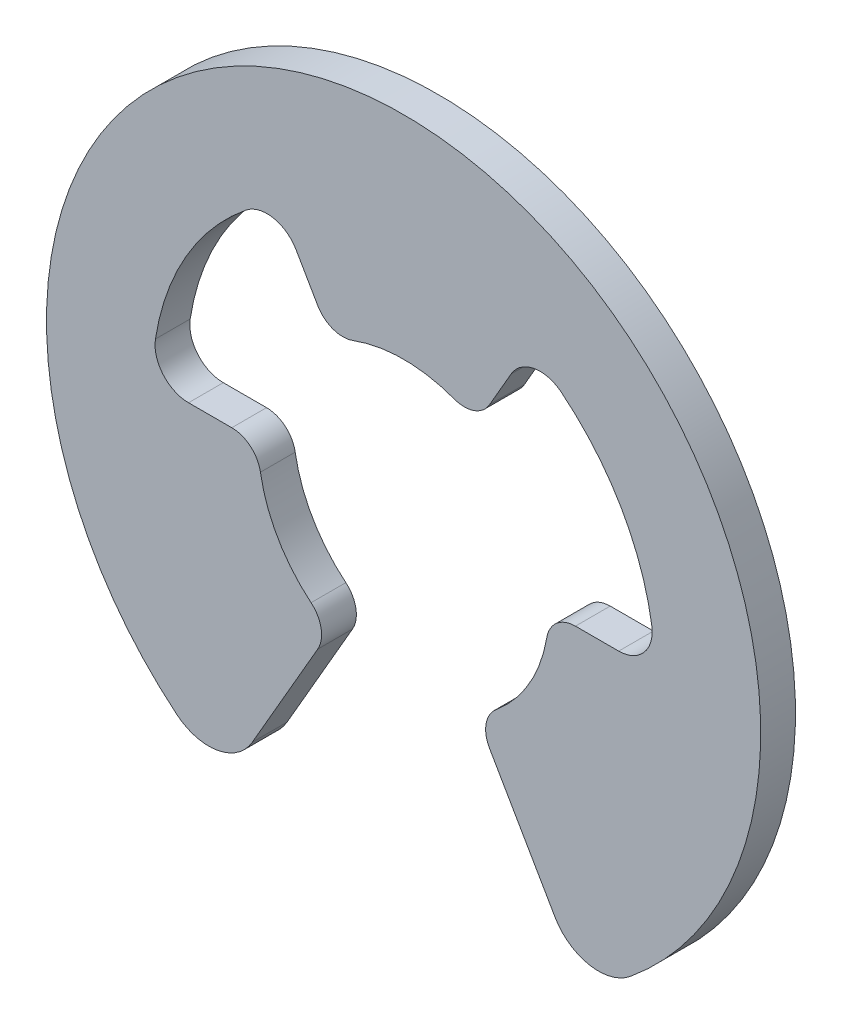
ISO-10303-21;
HEADER;
FILE_DESCRIPTION(('STEP AP214'),'2;1');
FILE_NAME('part.step','',(''),(''),'','','');
FILE_SCHEMA(('AUTOMOTIVE_DESIGN { 1 0 10303 214 1 1 1 1 }'));
ENDSEC;
DATA;
#1=APPLICATION_CONTEXT('core data for automotive mechanical design processes');
#2=APPLICATION_PROTOCOL_DEFINITION('international standard','automotive_design',2000,#1);
#3=PRODUCT_CONTEXT('',#1,'mechanical');
#4=PRODUCT('Part','Part','',(#3));
#5=PRODUCT_RELATED_PRODUCT_CATEGORY('part','',(#4));
#6=PRODUCT_DEFINITION_FORMATION('','',#4);
#7=PRODUCT_DEFINITION_CONTEXT('part definition',#1,'design');
#8=PRODUCT_DEFINITION('design','',#6,#7);
#9=PRODUCT_DEFINITION_SHAPE('','',#8);
#10=(LENGTH_UNIT() NAMED_UNIT(*) SI_UNIT(.MILLI.,.METRE.));
#11=(NAMED_UNIT(*) PLANE_ANGLE_UNIT() SI_UNIT($,.RADIAN.));
#12=(NAMED_UNIT(*) SI_UNIT($,.STERADIAN.) SOLID_ANGLE_UNIT());
#13=UNCERTAINTY_MEASURE_WITH_UNIT(LENGTH_MEASURE(1.E-05),#10,'distance_accuracy_value','');
#14=(GEOMETRIC_REPRESENTATION_CONTEXT(3) GLOBAL_UNCERTAINTY_ASSIGNED_CONTEXT((#13)) GLOBAL_UNIT_ASSIGNED_CONTEXT((#10,
#11,#12)) REPRESENTATION_CONTEXT('',''));
#15=CARTESIAN_POINT('',(0.,0.,0.));
#16=DIRECTION('',(0.,0.,1.));
#17=DIRECTION('',(1.,0.,0.));
#18=AXIS2_PLACEMENT_3D('',#15,#16,#17);
#19=CARTESIAN_POINT('',(2.2915935039836,-3.9691563791944,0.46355));
#20=DIRECTION('',(0.866025403784439,0.499999999999999,0.));
#21=DIRECTION('',(-0.499999999999999,0.866025403784439,0.));
#22=AXIS2_PLACEMENT_3D('',#19,#20,#21);
#23=PLANE('',#22);
#24=DIRECTION('',(0.499999999999998,-0.86602540378444,0.));
#25=VECTOR('',#24,1.);
#26=CARTESIAN_POINT('',(2.2915935039836,-3.9691563791944,-0.46355));
#27=LINE('',#26,#25);
#28=CARTESIAN_POINT('',(2.2915935039836,-3.9691563791944,-0.46355));
#29=VERTEX_POINT('',#28);
#30=CARTESIAN_POINT('',(4.037371747189,-6.99293299517449,-0.46355));
#31=VERTEX_POINT('',#30);
#32=EDGE_CURVE('E11',#29,#31,#27,.T.);
#33=ORIENTED_EDGE('',*,*,#32,.T.);
#34=DIRECTION('',(0.,0.,-1.));
#35=VECTOR('',#34,1.);
#36=CARTESIAN_POINT('',(4.037371747189,-6.99293299517449,0.46355));
#37=LINE('',#36,#35);
#38=CARTESIAN_POINT('',(4.037371747189,-6.99293299517449,0.46355));
#39=VERTEX_POINT('',#38);
#40=EDGE_CURVE('E25',#39,#31,#37,.T.);
#41=ORIENTED_EDGE('',*,*,#40,.F.);
#42=DIRECTION('',(0.499999999999998,-0.86602540378444,0.));
#43=VECTOR('',#42,1.);
#44=CARTESIAN_POINT('',(2.2915935039836,-3.9691563791944,0.46355));
#45=LINE('',#44,#43);
#46=CARTESIAN_POINT('',(2.2915935039836,-3.9691563791944,0.46355));
#47=VERTEX_POINT('',#46);
#48=EDGE_CURVE('E352',#47,#39,#45,.T.);
#49=ORIENTED_EDGE('',*,*,#48,.F.);
#50=DIRECTION('',(0.,0.,-1.));
#51=VECTOR('',#50,1.);
#52=CARTESIAN_POINT('',(2.2915935039836,-3.9691563791944,0.46355));
#53=LINE('',#52,#51);
#54=EDGE_CURVE('E348',#47,#29,#53,.T.);
#55=ORIENTED_EDGE('',*,*,#54,.T.);
#56=EDGE_LOOP('',(#33,#41,#49,#55));
#57=FACE_BOUND('',#56,.T.);
#58=ADVANCED_FACE('F17',(#57),#23,.F.);
#59=CARTESIAN_POINT('',(2.9625033842955,-3.58180637919445,0.46355));
#60=DIRECTION('',(0.,0.,1.));
#61=DIRECTION('',(0.984186439950093,-0.177135686461996,0.));
#62=AXIS2_PLACEMENT_3D('',#59,#60,#61);
#63=CYLINDRICAL_SURFACE('',#62,0.7747);
#64=CARTESIAN_POINT('',(2.9625033842955,-3.58180637919445,-0.46355));
#65=DIRECTION('',(0.,0.,1.));
#66=DIRECTION('',(1.,0.,0.));
#67=AXIS2_PLACEMENT_3D('',#64,#65,#66);
#68=CIRCLE('',#67,0.7747);
#69=CARTESIAN_POINT('',(2.4687528202462,-2.98483864932869,-0.46355));
#70=VERTEX_POINT('',#69);
#71=EDGE_CURVE('E343',#70,#29,#68,.T.);
#72=ORIENTED_EDGE('',*,*,#71,.T.);
#73=ORIENTED_EDGE('',*,*,#54,.F.);
#74=CARTESIAN_POINT('',(2.9625033842955,-3.58180637919445,0.46355));
#75=DIRECTION('',(0.,0.,1.));
#76=DIRECTION('',(1.,0.,0.));
#77=AXIS2_PLACEMENT_3D('',#74,#75,#76);
#78=CIRCLE('',#77,0.7747);
#79=CARTESIAN_POINT('',(2.4687528202462,-2.98483864932869,0.46355));
#80=VERTEX_POINT('',#79);
#81=EDGE_CURVE('E338',#80,#47,#78,.T.);
#82=ORIENTED_EDGE('',*,*,#81,.F.);
#83=DIRECTION('',(0.,0.,-1.));
#84=VECTOR('',#83,1.);
#85=CARTESIAN_POINT('',(2.4687528202462,-2.98483864932869,0.46355));
#86=LINE('',#85,#84);
#87=EDGE_CURVE('E334',#80,#70,#86,.T.);
#88=ORIENTED_EDGE('',*,*,#87,.T.);
#89=EDGE_LOOP('',(#72,#73,#82,#88));
#90=FACE_BOUND('',#89,.T.);
#91=ADVANCED_FACE('F365',(#90),#63,.T.);
#92=CARTESIAN_POINT('',(-2.51101223147643E-13,1.63714528045311E-13,0.46355));
#93=DIRECTION('',(0.,0.,1.));
#94=DIRECTION('',(-0.866025402257679,0.500000002644425,0.));
#95=AXIS2_PLACEMENT_3D('',#92,#93,#94);
#96=CYLINDRICAL_SURFACE('',#95,3.8735);
#97=DIRECTION('',(0.,0.,-1.));
#98=VECTOR('',#97,1.);
#99=CARTESIAN_POINT('',(3.81932250269679,-0.64558335665806,0.46355));
#100=LINE('',#99,#98);
#101=CARTESIAN_POINT('',(3.81932250269679,-0.64558335665806,0.46355));
#102=VERTEX_POINT('',#101);
#103=CARTESIAN_POINT('',(3.81932250269679,-0.64558335665806,-0.46355));
#104=VERTEX_POINT('',#103);
#105=EDGE_CURVE('E330',#102,#104,#100,.T.);
#106=ORIENTED_EDGE('',*,*,#105,.T.);
#107=CARTESIAN_POINT('',(-2.51101223147643E-13,1.63714528045311E-13,-0.46355));
#108=DIRECTION('',(0.,0.,1.));
#109=DIRECTION('',(1.,0.,0.));
#110=AXIS2_PLACEMENT_3D('',#107,#108,#109);
#111=CIRCLE('',#110,3.8735);
#112=EDGE_CURVE('E325',#70,#104,#111,.T.);
#113=ORIENTED_EDGE('',*,*,#112,.F.);
#114=ORIENTED_EDGE('',*,*,#87,.F.);
#115=CARTESIAN_POINT('',(-2.51101223147643E-13,1.63714528045311E-13,0.46355));
#116=DIRECTION('',(0.,0.,1.));
#117=DIRECTION('',(1.,0.,0.));
#118=AXIS2_PLACEMENT_3D('',#115,#116,#117);
#119=CIRCLE('',#118,3.8735);
#120=EDGE_CURVE('E321',#80,#102,#119,.T.);
#121=ORIENTED_EDGE('',*,*,#120,.T.);
#122=EDGE_LOOP('',(#106,#113,#114,#121));
#123=FACE_BOUND('',#122,.T.);
#124=ADVANCED_FACE('F372',(#123),#96,.F.);
#125=CARTESIAN_POINT('',(5.19771588444955,-6.32300799517454,0.46355));
#126=DIRECTION('',(0.,0.,1.));
#127=DIRECTION('',(1.,0.,0.));
#128=AXIS2_PLACEMENT_3D('',#125,#126,#127);
#129=PLANE('',#128);
#130=CARTESIAN_POINT('',(5.19771588444955,-6.32300799517454,0.46355));
#131=DIRECTION('',(0.,0.,1.));
#132=DIRECTION('',(1.,0.,0.));
#133=AXIS2_PLACEMENT_3D('',#130,#131,#132);
#134=CIRCLE('',#133,1.33985);
#135=CARTESIAN_POINT('',(6.04854438804611,-7.35803885460221,0.46355));
#136=VERTEX_POINT('',#135);
#137=EDGE_CURVE('E317',#39,#136,#134,.T.);
#138=ORIENTED_EDGE('',*,*,#137,.T.);
#139=CARTESIAN_POINT('',(0.,0.,0.46355));
#140=DIRECTION('',(0.,0.,1.));
#141=DIRECTION('',(1.,0.,0.));
#142=AXIS2_PLACEMENT_3D('',#139,#140,#141);
#143=CIRCLE('',#142,9.525);
#144=CARTESIAN_POINT('',(-6.04854447375821,-7.3580387841441,0.46355));
#145=VERTEX_POINT('',#144);
#146=EDGE_CURVE('E189',#136,#145,#143,.T.);
#147=ORIENTED_EDGE('',*,*,#146,.T.);
#148=CARTESIAN_POINT('',(-5.19771588444955,-6.32300799517454,0.46355));
#149=DIRECTION('',(0.,0.,1.));
#150=DIRECTION('',(1.,0.,0.));
#151=AXIS2_PLACEMENT_3D('',#148,#149,#150);
#152=CIRCLE('',#151,1.33985);
#153=CARTESIAN_POINT('',(-4.037371747189,-6.99293299517449,0.46355));
#154=VERTEX_POINT('',#153);
#155=EDGE_CURVE('E310',#145,#154,#152,.T.);
#156=ORIENTED_EDGE('',*,*,#155,.T.);
#157=DIRECTION('',(0.499999999999998,0.86602540378444,0.));
#158=VECTOR('',#157,1.);
#159=CARTESIAN_POINT('',(-4.037371747189,-6.99293299517449,0.46355));
#160=LINE('',#159,#158);
#161=CARTESIAN_POINT('',(-2.2915935039836,-3.9691563791944,0.46355));
#162=VERTEX_POINT('',#161);
#163=EDGE_CURVE('E306',#154,#162,#160,.T.);
#164=ORIENTED_EDGE('',*,*,#163,.T.);
#165=CARTESIAN_POINT('',(-2.9625033842955,-3.58180637919445,0.46355));
#166=DIRECTION('',(0.,0.,1.));
#167=DIRECTION('',(1.,0.,0.));
#168=AXIS2_PLACEMENT_3D('',#165,#166,#167);
#169=CIRCLE('',#168,0.7747);
#170=CARTESIAN_POINT('',(-2.4687528202462,-2.98483864932869,0.46355));
#171=VERTEX_POINT('',#170);
#172=EDGE_CURVE('E302',#162,#171,#169,.T.);
#173=ORIENTED_EDGE('',*,*,#172,.T.);
#174=CARTESIAN_POINT('',(2.57606436182556E-13,1.69135538907739E-13,0.46355));
#175=DIRECTION('',(0.,0.,1.));
#176=DIRECTION('',(1.,0.,0.));
#177=AXIS2_PLACEMENT_3D('',#174,#175,#176);
#178=CIRCLE('',#177,3.8735);
#179=CARTESIAN_POINT('',(-3.8193225066394,-0.645583333333329,0.46355));
#180=VERTEX_POINT('',#179);
#181=EDGE_CURVE('E297',#180,#171,#178,.T.);
#182=ORIENTED_EDGE('',*,*,#181,.F.);
#183=CARTESIAN_POINT('',(-4.58318700796734,-0.774700000000079,0.46355));
#184=DIRECTION('',(0.,0.,1.));
#185=DIRECTION('',(1.,0.,0.));
#186=AXIS2_PLACEMENT_3D('',#183,#184,#185);
#187=CIRCLE('',#186,0.7747);
#188=CARTESIAN_POINT('',(-4.58318700796729,0.,0.46355));
#189=VERTEX_POINT('',#188);
#190=EDGE_CURVE('E293',#180,#189,#187,.T.);
#191=ORIENTED_EDGE('',*,*,#190,.T.);
#192=DIRECTION('',(-1.,0.,0.));
#193=VECTOR('',#192,1.);
#194=CARTESIAN_POINT('',(-4.58318700796729,0.,0.46355));
#195=LINE('',#194,#193);
#196=CARTESIAN_POINT('',(-5.73689495684149,0.,0.46355));
#197=VERTEX_POINT('',#196);
#198=EDGE_CURVE('E289',#189,#197,#195,.T.);
#199=ORIENTED_EDGE('',*,*,#198,.T.);
#200=CARTESIAN_POINT('',(-5.73689495684144,0.893233333333415,0.46355));
#201=DIRECTION('',(0.,0.,1.));
#202=DIRECTION('',(1.,0.,0.));
#203=AXIS2_PLACEMENT_3D('',#200,#201,#202);
#204=CIRCLE('',#203,0.89323333418);
#205=CARTESIAN_POINT('',(-6.61949418097101,1.0306538461538,0.46355));
#206=VERTEX_POINT('',#205);
#207=EDGE_CURVE('E284',#206,#197,#204,.T.);
#208=ORIENTED_EDGE('',*,*,#207,.F.);
#209=CARTESIAN_POINT('',(1.12757025938493E-13,-1.59594559789866E-13,0.46355));
#210=DIRECTION('',(0.,0.,1.));
#211=DIRECTION('',(1.,0.,0.));
#212=AXIS2_PLACEMENT_3D('',#209,#210,#211);
#213=CIRCLE('',#212,6.69925);
#214=CARTESIAN_POINT('',(-4.2023195037628,5.21732319784721,0.46355));
#215=VERTEX_POINT('',#214);
#216=EDGE_CURVE('E279',#215,#206,#213,.T.);
#217=ORIENTED_EDGE('',*,*,#216,.F.);
#218=CARTESIAN_POINT('',(-3.64201023659442,4.52168010480082,0.46355));
#219=DIRECTION('',(0.,0.,1.));
#220=DIRECTION('',(1.,0.,0.));
#221=AXIS2_PLACEMENT_3D('',#218,#219,#220);
#222=CIRCLE('',#221,0.89323333418);
#223=CARTESIAN_POINT('',(-2.8684474784207,4.96829677146761,0.46355));
#224=VERTEX_POINT('',#223);
#225=EDGE_CURVE('E274',#224,#215,#222,.T.);
#226=ORIENTED_EDGE('',*,*,#225,.F.);
#227=DIRECTION('',(0.499999999999961,-0.866025403784461,0.));
#228=VECTOR('',#227,1.);
#229=CARTESIAN_POINT('',(-2.8684474784207,4.96829677146761,0.46355));
#230=LINE('',#229,#228);
#231=CARTESIAN_POINT('',(-2.2915935039836,3.9691563791944,0.46355));
#232=VERTEX_POINT('',#231);
#233=EDGE_CURVE('E270',#224,#232,#230,.T.);
#234=ORIENTED_EDGE('',*,*,#233,.T.);
#235=CARTESIAN_POINT('',(-1.62068362367182,4.35650637919443,0.46355));
#236=DIRECTION('',(0.,0.,1.));
#237=DIRECTION('',(1.,0.,0.));
#238=AXIS2_PLACEMENT_3D('',#235,#236,#237);
#239=CIRCLE('',#238,0.7747);
#240=CARTESIAN_POINT('',(-1.3505696449148,3.63042199809261,0.46355));
#241=VERTEX_POINT('',#240);
#242=EDGE_CURVE('E266',#232,#241,#239,.T.);
#243=ORIENTED_EDGE('',*,*,#242,.T.);
#244=CARTESIAN_POINT('',(0.,3.45643652588379E-13,0.46355));
#245=DIRECTION('',(0.,0.,1.));
#246=DIRECTION('',(1.,0.,0.));
#247=AXIS2_PLACEMENT_3D('',#244,#245,#246);
#248=CIRCLE('',#247,3.8735);
#249=CARTESIAN_POINT('',(1.3505696863932,3.63042198266201,0.46355));
#250=VERTEX_POINT('',#249);
#251=EDGE_CURVE('E261',#250,#241,#248,.T.);
#252=ORIENTED_EDGE('',*,*,#251,.F.);
#253=CARTESIAN_POINT('',(1.62068362367178,4.35650637919448,0.46355));
#254=DIRECTION('',(0.,0.,1.));
#255=DIRECTION('',(1.,0.,0.));
#256=AXIS2_PLACEMENT_3D('',#253,#254,#255);
#257=CIRCLE('',#256,0.7747);
#258=CARTESIAN_POINT('',(2.2915935039836,3.9691563791944,0.46355));
#259=VERTEX_POINT('',#258);
#260=EDGE_CURVE('E257',#250,#259,#257,.T.);
#261=ORIENTED_EDGE('',*,*,#260,.T.);
#262=DIRECTION('',(0.499999999999961,0.866025403784461,0.));
#263=VECTOR('',#262,1.);
#264=CARTESIAN_POINT('',(2.2915935039836,3.9691563791944,0.46355));
#265=LINE('',#264,#263);
#266=CARTESIAN_POINT('',(2.8684474784207,4.96829677146761,0.46355));
#267=VERTEX_POINT('',#266);
#268=EDGE_CURVE('E253',#259,#267,#265,.T.);
#269=ORIENTED_EDGE('',*,*,#268,.T.);
#270=CARTESIAN_POINT('',(3.64201023659442,4.52168010480082,0.46355));
#271=DIRECTION('',(0.,0.,1.));
#272=DIRECTION('',(1.,0.,0.));
#273=AXIS2_PLACEMENT_3D('',#270,#271,#272);
#274=CIRCLE('',#273,0.89323333418);
#275=CARTESIAN_POINT('',(4.2023195037628,5.21732319784719,0.46355));
#276=VERTEX_POINT('',#275);
#277=EDGE_CURVE('E248',#276,#267,#274,.T.);
#278=ORIENTED_EDGE('',*,*,#277,.F.);
#279=CARTESIAN_POINT('',(4.55364912443911E-13,3.26995375221627E-13,0.46355));
#280=DIRECTION('',(0.,0.,1.));
#281=DIRECTION('',(1.,0.,0.));
#282=AXIS2_PLACEMENT_3D('',#279,#280,#281);
#283=CIRCLE('',#282,6.69925);
#284=CARTESIAN_POINT('',(6.61949418097091,1.0306538461538,0.46355));
#285=VERTEX_POINT('',#284);
#286=EDGE_CURVE('E243',#285,#276,#283,.T.);
#287=ORIENTED_EDGE('',*,*,#286,.F.);
#288=CARTESIAN_POINT('',(5.73689495684149,0.893233333333273,0.46355));
#289=DIRECTION('',(0.,0.,1.));
#290=DIRECTION('',(1.,0.,0.));
#291=AXIS2_PLACEMENT_3D('',#288,#289,#290);
#292=CIRCLE('',#291,0.89323333418);
#293=CARTESIAN_POINT('',(5.73689495684149,0.,0.46355));
#294=VERTEX_POINT('',#293);
#295=EDGE_CURVE('E238',#294,#285,#292,.T.);
#296=ORIENTED_EDGE('',*,*,#295,.F.);
#297=DIRECTION('',(-1.,0.,0.));
#298=VECTOR('',#297,1.);
#299=CARTESIAN_POINT('',(5.73689495684149,0.,0.46355));
#300=LINE('',#299,#298);
#301=CARTESIAN_POINT('',(4.58318700796729,0.,0.46355));
#302=VERTEX_POINT('',#301);
#303=EDGE_CURVE('E234',#294,#302,#300,.T.);
#304=ORIENTED_EDGE('',*,*,#303,.T.);
#305=CARTESIAN_POINT('',(4.58318700796734,-0.774700000000081,0.46355));
#306=DIRECTION('',(0.,0.,1.));
#307=DIRECTION('',(1.,0.,0.));
#308=AXIS2_PLACEMENT_3D('',#305,#306,#307);
#309=CIRCLE('',#308,0.7747);
#310=EDGE_CURVE('E229',#302,#102,#309,.T.);
#311=ORIENTED_EDGE('',*,*,#310,.T.);
#312=ORIENTED_EDGE('',*,*,#120,.F.);
#313=ORIENTED_EDGE('',*,*,#81,.T.);
#314=ORIENTED_EDGE('',*,*,#48,.T.);
#315=EDGE_LOOP('',(#138,#147,#156,#164,#173,#182,#191,#199,#208,#217,#226,#234,#243,#252,#261,
#269,#278,#287,#296,#304,#311,#312,#313,#314));
#316=FACE_BOUND('',#315,.T.);
#317=ADVANCED_FACE('F361',(#316),#129,.T.);
#318=CARTESIAN_POINT('',(4.58318700796734,-0.774700000000081,0.46355));
#319=DIRECTION('',(0.,0.,1.));
#320=DIRECTION('',(0.645497236028702,-0.763762605970799,0.));
#321=AXIS2_PLACEMENT_3D('',#318,#319,#320);
#322=CYLINDRICAL_SURFACE('',#321,0.7747);
#323=CARTESIAN_POINT('',(4.58318700796734,-0.774700000000081,-0.46355));
#324=DIRECTION('',(0.,0.,1.));
#325=DIRECTION('',(1.,0.,0.));
#326=AXIS2_PLACEMENT_3D('',#323,#324,#325);
#327=CIRCLE('',#326,0.7747);
#328=CARTESIAN_POINT('',(4.58318700796729,0.,-0.46355));
#329=VERTEX_POINT('',#328);
#330=EDGE_CURVE('E224',#329,#104,#327,.T.);
#331=ORIENTED_EDGE('',*,*,#330,.T.);
#332=ORIENTED_EDGE('',*,*,#105,.F.);
#333=ORIENTED_EDGE('',*,*,#310,.F.);
#334=DIRECTION('',(0.,0.,-1.));
#335=VECTOR('',#334,1.);
#336=CARTESIAN_POINT('',(4.58318700796729,0.,0.46355));
#337=LINE('',#336,#335);
#338=EDGE_CURVE('E220',#302,#329,#337,.T.);
#339=ORIENTED_EDGE('',*,*,#338,.T.);
#340=EDGE_LOOP('',(#331,#332,#333,#339));
#341=FACE_BOUND('',#340,.T.);
#342=ADVANCED_FACE('F376',(#341),#322,.T.);
#343=CARTESIAN_POINT('',(5.73689495684149,0.,0.46355));
#344=DIRECTION('',(0.,-1.,0.));
#345=DIRECTION('',(0.,0.,-1.));
#346=AXIS2_PLACEMENT_3D('',#343,#344,#345);
#347=PLANE('',#346);
#348=DIRECTION('',(-1.,0.,0.));
#349=VECTOR('',#348,1.);
#350=CARTESIAN_POINT('',(5.73689495684149,0.,-0.46355));
#351=LINE('',#350,#349);
#352=CARTESIAN_POINT('',(5.73689495684149,0.,-0.46355));
#353=VERTEX_POINT('',#352);
#354=EDGE_CURVE('E215',#353,#329,#351,.T.);
#355=ORIENTED_EDGE('',*,*,#354,.T.);
#356=ORIENTED_EDGE('',*,*,#338,.F.);
#357=ORIENTED_EDGE('',*,*,#303,.F.);
#358=DIRECTION('',(0.,0.,-1.));
#359=VECTOR('',#358,1.);
#360=CARTESIAN_POINT('',(5.73689495684149,0.,0.46355));
#361=LINE('',#360,#359);
#362=EDGE_CURVE('E211',#294,#353,#361,.T.);
#363=ORIENTED_EDGE('',*,*,#362,.T.);
#364=EDGE_LOOP('',(#355,#356,#357,#363));
#365=FACE_BOUND('',#364,.T.);
#366=ADVANCED_FACE('F380',(#365),#347,.F.);
#367=CARTESIAN_POINT('',(5.73689495684149,0.893233333333273,0.46355));
#368=DIRECTION('',(0.,0.,1.));
#369=DIRECTION('',(-0.759554525312758,0.650443635587982,0.));
#370=AXIS2_PLACEMENT_3D('',#367,#368,#369);
#371=CYLINDRICAL_SURFACE('',#370,0.89323333418);
#372=DIRECTION('',(0.,0.,-1.));
#373=VECTOR('',#372,1.);
#374=CARTESIAN_POINT('',(6.61949418097091,1.0306538461538,0.46355));
#375=LINE('',#374,#373);
#376=CARTESIAN_POINT('',(6.61949418097091,1.0306538461538,-0.46355));
#377=VERTEX_POINT('',#376);
#378=EDGE_CURVE('E199',#285,#377,#375,.T.);
#379=ORIENTED_EDGE('',*,*,#378,.T.);
#380=CARTESIAN_POINT('',(5.73689495684149,0.893233333333273,-0.46355));
#381=DIRECTION('',(0.,0.,1.));
#382=DIRECTION('',(1.,0.,0.));
#383=AXIS2_PLACEMENT_3D('',#380,#381,#382);
#384=CIRCLE('',#383,0.89323333418);
#385=EDGE_CURVE('E195',#353,#377,#384,.T.);
#386=ORIENTED_EDGE('',*,*,#385,.F.);
#387=ORIENTED_EDGE('',*,*,#362,.F.);
#388=ORIENTED_EDGE('',*,*,#295,.T.);
#389=EDGE_LOOP('',(#379,#386,#387,#388));
#390=FACE_BOUND('',#389,.T.);
#391=ADVANCED_FACE('F619',(#390),#371,.F.);
#392=CARTESIAN_POINT('',(5.19771588444955,-6.32300799517454,-0.46355));
#393=DIRECTION('',(0.,0.,1.));
#394=DIRECTION('',(1.,0.,0.));
#395=AXIS2_PLACEMENT_3D('',#392,#393,#394);
#396=PLANE('',#395);
#397=CARTESIAN_POINT('',(5.19771588444955,-6.32300799517454,-0.46355));
#398=DIRECTION('',(0.,0.,1.));
#399=DIRECTION('',(1.,0.,0.));
#400=AXIS2_PLACEMENT_3D('',#397,#398,#399);
#401=CIRCLE('',#400,1.33985);
#402=CARTESIAN_POINT('',(6.04854438804611,-7.35803885460221,-0.46355));
#403=VERTEX_POINT('',#402);
#404=EDGE_CURVE('E177',#31,#403,#401,.T.);
#405=ORIENTED_EDGE('',*,*,#404,.F.);
#406=ORIENTED_EDGE('',*,*,#32,.F.);
#407=ORIENTED_EDGE('',*,*,#71,.F.);
#408=ORIENTED_EDGE('',*,*,#112,.T.);
#409=ORIENTED_EDGE('',*,*,#330,.F.);
#410=ORIENTED_EDGE('',*,*,#354,.F.);
#411=ORIENTED_EDGE('',*,*,#385,.T.);
#412=CARTESIAN_POINT('',(4.55364912443911E-13,3.26995375221627E-13,-0.46355));
#413=DIRECTION('',(0.,0.,1.));
#414=DIRECTION('',(1.,0.,0.));
#415=AXIS2_PLACEMENT_3D('',#412,#413,#414);
#416=CIRCLE('',#415,6.69925);
#417=CARTESIAN_POINT('',(4.2023195037628,5.21732319784719,-0.46355));
#418=VERTEX_POINT('',#417);
#419=EDGE_CURVE('E196',#377,#418,#416,.T.);
#420=ORIENTED_EDGE('',*,*,#419,.T.);
#421=CARTESIAN_POINT('',(3.64201023659442,4.52168010480082,-0.46355));
#422=DIRECTION('',(0.,0.,1.));
#423=DIRECTION('',(1.,0.,0.));
#424=AXIS2_PLACEMENT_3D('',#421,#422,#423);
#425=CIRCLE('',#424,0.89323333418);
#426=CARTESIAN_POINT('',(2.8684474784207,4.96829677146761,-0.46355));
#427=VERTEX_POINT('',#426);
#428=EDGE_CURVE('E201',#418,#427,#425,.T.);
#429=ORIENTED_EDGE('',*,*,#428,.T.);
#430=DIRECTION('',(0.499999999999961,0.866025403784461,0.));
#431=VECTOR('',#430,1.);
#432=CARTESIAN_POINT('',(2.2915935039836,3.9691563791944,-0.46355));
#433=LINE('',#432,#431);
#434=CARTESIAN_POINT('',(2.2915935039836,3.9691563791944,-0.46355));
#435=VERTEX_POINT('',#434);
#436=EDGE_CURVE('E529',#435,#427,#433,.T.);
#437=ORIENTED_EDGE('',*,*,#436,.F.);
#438=CARTESIAN_POINT('',(1.62068362367178,4.35650637919448,-0.46355));
#439=DIRECTION('',(0.,0.,1.));
#440=DIRECTION('',(1.,0.,0.));
#441=AXIS2_PLACEMENT_3D('',#438,#439,#440);
#442=CIRCLE('',#441,0.7747);
#443=CARTESIAN_POINT('',(1.3505696863932,3.63042198266201,-0.46355));
#444=VERTEX_POINT('',#443);
#445=EDGE_CURVE('E524',#444,#435,#442,.T.);
#446=ORIENTED_EDGE('',*,*,#445,.F.);
#447=CARTESIAN_POINT('',(0.,3.45643652588379E-13,-0.46355));
#448=DIRECTION('',(0.,0.,1.));
#449=DIRECTION('',(1.,0.,0.));
#450=AXIS2_PLACEMENT_3D('',#447,#448,#449);
#451=CIRCLE('',#450,3.8735);
#452=CARTESIAN_POINT('',(-1.3505696449148,3.63042199809261,-0.46355));
#453=VERTEX_POINT('',#452);
#454=EDGE_CURVE('E520',#444,#453,#451,.T.);
#455=ORIENTED_EDGE('',*,*,#454,.T.);
#456=CARTESIAN_POINT('',(-1.62068362367182,4.35650637919443,-0.46355));
#457=DIRECTION('',(0.,0.,1.));
#458=DIRECTION('',(1.,0.,0.));
#459=AXIS2_PLACEMENT_3D('',#456,#457,#458);
#460=CIRCLE('',#459,0.7747);
#461=CARTESIAN_POINT('',(-2.2915935039836,3.9691563791944,-0.46355));
#462=VERTEX_POINT('',#461);
#463=EDGE_CURVE('E515',#462,#453,#460,.T.);
#464=ORIENTED_EDGE('',*,*,#463,.F.);
#465=DIRECTION('',(0.499999999999961,-0.866025403784461,0.));
#466=VECTOR('',#465,1.);
#467=CARTESIAN_POINT('',(-2.8684474784207,4.96829677146761,-0.46355));
#468=LINE('',#467,#466);
#469=CARTESIAN_POINT('',(-2.8684474784207,4.96829677146761,-0.46355));
#470=VERTEX_POINT('',#469);
#471=EDGE_CURVE('E510',#470,#462,#468,.T.);
#472=ORIENTED_EDGE('',*,*,#471,.F.);
#473=CARTESIAN_POINT('',(-3.64201023659442,4.52168010480082,-0.46355));
#474=DIRECTION('',(0.,0.,1.));
#475=DIRECTION('',(1.,0.,0.));
#476=AXIS2_PLACEMENT_3D('',#473,#474,#475);
#477=CIRCLE('',#476,0.89323333418);
#478=CARTESIAN_POINT('',(-4.2023195037628,5.21732319784721,-0.46355));
#479=VERTEX_POINT('',#478);
#480=EDGE_CURVE('E506',#470,#479,#477,.T.);
#481=ORIENTED_EDGE('',*,*,#480,.T.);
#482=CARTESIAN_POINT('',(1.12757025938493E-13,-1.59594559789866E-13,-0.46355));
#483=DIRECTION('',(0.,0.,1.));
#484=DIRECTION('',(1.,0.,0.));
#485=AXIS2_PLACEMENT_3D('',#482,#483,#484);
#486=CIRCLE('',#485,6.69925);
#487=CARTESIAN_POINT('',(-6.61949418097101,1.0306538461538,-0.46355));
#488=VERTEX_POINT('',#487);
#489=EDGE_CURVE('E502',#479,#488,#486,.T.);
#490=ORIENTED_EDGE('',*,*,#489,.T.);
#491=CARTESIAN_POINT('',(-5.73689495684144,0.893233333333415,-0.46355));
#492=DIRECTION('',(0.,0.,1.));
#493=DIRECTION('',(1.,0.,0.));
#494=AXIS2_PLACEMENT_3D('',#491,#492,#493);
#495=CIRCLE('',#494,0.89323333418);
#496=CARTESIAN_POINT('',(-5.73689495684149,0.,-0.46355));
#497=VERTEX_POINT('',#496);
#498=EDGE_CURVE('E498',#488,#497,#495,.T.);
#499=ORIENTED_EDGE('',*,*,#498,.T.);
#500=DIRECTION('',(-1.,0.,0.));
#501=VECTOR('',#500,1.);
#502=CARTESIAN_POINT('',(-4.58318700796729,0.,-0.46355));
#503=LINE('',#502,#501);
#504=CARTESIAN_POINT('',(-4.58318700796729,0.,-0.46355));
#505=VERTEX_POINT('',#504);
#506=EDGE_CURVE('E493',#505,#497,#503,.T.);
#507=ORIENTED_EDGE('',*,*,#506,.F.);
#508=CARTESIAN_POINT('',(-4.58318700796734,-0.774700000000079,-0.46355));
#509=DIRECTION('',(0.,0.,1.));
#510=DIRECTION('',(1.,0.,0.));
#511=AXIS2_PLACEMENT_3D('',#508,#509,#510);
#512=CIRCLE('',#511,0.7747);
#513=CARTESIAN_POINT('',(-3.8193225066394,-0.645583333333329,-0.46355));
#514=VERTEX_POINT('',#513);
#515=EDGE_CURVE('E488',#514,#505,#512,.T.);
#516=ORIENTED_EDGE('',*,*,#515,.F.);
#517=CARTESIAN_POINT('',(2.57606436182556E-13,1.69135538907739E-13,-0.46355));
#518=DIRECTION('',(0.,0.,1.));
#519=DIRECTION('',(1.,0.,0.));
#520=AXIS2_PLACEMENT_3D('',#517,#518,#519);
#521=CIRCLE('',#520,3.8735);
#522=CARTESIAN_POINT('',(-2.4687528202462,-2.98483864932869,-0.46355));
#523=VERTEX_POINT('',#522);
#524=EDGE_CURVE('E484',#514,#523,#521,.T.);
#525=ORIENTED_EDGE('',*,*,#524,.T.);
#526=CARTESIAN_POINT('',(-2.9625033842955,-3.58180637919445,-0.46355));
#527=DIRECTION('',(0.,0.,1.));
#528=DIRECTION('',(1.,0.,0.));
#529=AXIS2_PLACEMENT_3D('',#526,#527,#528);
#530=CIRCLE('',#529,0.7747);
#531=CARTESIAN_POINT('',(-2.2915935039836,-3.9691563791944,-0.46355));
#532=VERTEX_POINT('',#531);
#533=EDGE_CURVE('E479',#532,#523,#530,.T.);
#534=ORIENTED_EDGE('',*,*,#533,.F.);
#535=DIRECTION('',(0.499999999999998,0.86602540378444,0.));
#536=VECTOR('',#535,1.);
#537=CARTESIAN_POINT('',(-4.037371747189,-6.99293299517449,-0.46355));
#538=LINE('',#537,#536);
#539=CARTESIAN_POINT('',(-4.037371747189,-6.99293299517449,-0.46355));
#540=VERTEX_POINT('',#539);
#541=EDGE_CURVE('E474',#540,#532,#538,.T.);
#542=ORIENTED_EDGE('',*,*,#541,.F.);
#543=CARTESIAN_POINT('',(-5.19771588444955,-6.32300799517454,-0.46355));
#544=DIRECTION('',(0.,0.,1.));
#545=DIRECTION('',(1.,0.,0.));
#546=AXIS2_PLACEMENT_3D('',#543,#544,#545);
#547=CIRCLE('',#546,1.33985);
#548=CARTESIAN_POINT('',(-6.04854447375821,-7.3580387841441,-0.46355));
#549=VERTEX_POINT('',#548);
#550=EDGE_CURVE('E179',#549,#540,#547,.T.);
#551=ORIENTED_EDGE('',*,*,#550,.F.);
#552=CARTESIAN_POINT('',(0.,0.,-0.46355));
#553=DIRECTION('',(0.,0.,1.));
#554=DIRECTION('',(1.,0.,0.));
#555=AXIS2_PLACEMENT_3D('',#552,#553,#554);
#556=CIRCLE('',#555,9.525);
#557=EDGE_CURVE('E173',#403,#549,#556,.T.);
#558=ORIENTED_EDGE('',*,*,#557,.F.);
#559=EDGE_LOOP('',(#405,#406,#407,#408,#409,#410,#411,#420,#429,#437,#446,#455,#464,#472,#481,
#490,#499,#507,#516,#525,#534,#542,#551,#558));
#560=FACE_BOUND('',#559,.T.);
#561=ADVANCED_FACE('F175',(#560),#396,.F.);
#562=CARTESIAN_POINT('',(0.,0.,0.46355));
#563=DIRECTION('',(0.,0.,1.));
#564=DIRECTION('',(-5.82438481350554E-09,-1.,0.));
#565=AXIS2_PLACEMENT_3D('',#562,#563,#564);
#566=CYLINDRICAL_SURFACE('',#565,9.525);
#567=ORIENTED_EDGE('',*,*,#557,.T.);
#568=DIRECTION('',(0.,0.,-1.));
#569=VECTOR('',#568,1.);
#570=CARTESIAN_POINT('',(-6.04854447375821,-7.3580387841441,0.46355));
#571=LINE('',#570,#569);
#572=EDGE_CURVE('E183',#145,#549,#571,.T.);
#573=ORIENTED_EDGE('',*,*,#572,.F.);
#574=ORIENTED_EDGE('',*,*,#146,.F.);
#575=DIRECTION('',(0.,0.,-1.));
#576=VECTOR('',#575,1.);
#577=CARTESIAN_POINT('',(6.04854438804611,-7.35803885460221,0.46355));
#578=LINE('',#577,#576);
#579=EDGE_CURVE('E187',#136,#403,#578,.T.);
#580=ORIENTED_EDGE('',*,*,#579,.T.);
#581=EDGE_LOOP('',(#567,#573,#574,#580));
#582=FACE_BOUND('',#581,.T.);
#583=ADVANCED_FACE('F188',(#582),#566,.T.);
#584=CARTESIAN_POINT('',(5.19771588444955,-6.32300799517454,0.46355));
#585=DIRECTION('',(0.,0.,1.));
#586=DIRECTION('',(0.178619335258675,0.983918255279243,0.));
#587=AXIS2_PLACEMENT_3D('',#584,#585,#586);
#588=CYLINDRICAL_SURFACE('',#587,1.33985);
#589=ORIENTED_EDGE('',*,*,#404,.T.);
#590=ORIENTED_EDGE('',*,*,#579,.F.);
#591=ORIENTED_EDGE('',*,*,#137,.F.);
#592=ORIENTED_EDGE('',*,*,#40,.T.);
#593=EDGE_LOOP('',(#589,#590,#591,#592));
#594=FACE_BOUND('',#593,.T.);
#595=ADVANCED_FACE('F194',(#594),#588,.T.);
#596=CARTESIAN_POINT('',(-5.19771588444955,-6.32300799517454,0.46355));
#597=DIRECTION('',(0.,0.,1.));
#598=DIRECTION('',(-0.178619294518969,0.983918262675079,0.));
#599=AXIS2_PLACEMENT_3D('',#596,#597,#598);
#600=CYLINDRICAL_SURFACE('',#599,1.33985);
#601=ORIENTED_EDGE('',*,*,#550,.T.);
#602=DIRECTION('',(0.,0.,-1.));
#603=VECTOR('',#602,1.);
#604=CARTESIAN_POINT('',(-4.037371747189,-6.99293299517449,0.46355));
#605=LINE('',#604,#603);
#606=EDGE_CURVE('E192',#154,#540,#605,.T.);
#607=ORIENTED_EDGE('',*,*,#606,.F.);
#608=ORIENTED_EDGE('',*,*,#155,.F.);
#609=ORIENTED_EDGE('',*,*,#572,.T.);
#610=EDGE_LOOP('',(#601,#607,#608,#609));
#611=FACE_BOUND('',#610,.T.);
#612=ADVANCED_FACE('F594',(#611),#600,.T.);
#613=CARTESIAN_POINT('',(-4.037371747189,-6.99293299517449,0.46355));
#614=DIRECTION('',(-0.866025403784439,0.499999999999999,0.));
#615=DIRECTION('',(-0.499999999999999,-0.866025403784439,0.));
#616=AXIS2_PLACEMENT_3D('',#613,#614,#615);
#617=PLANE('',#616);
#618=ORIENTED_EDGE('',*,*,#541,.T.);
#619=DIRECTION('',(0.,0.,-1.));
#620=VECTOR('',#619,1.);
#621=CARTESIAN_POINT('',(-2.2915935039836,-3.9691563791944,0.46355));
#622=LINE('',#621,#620);
#623=EDGE_CURVE('E455',#162,#532,#622,.T.);
#624=ORIENTED_EDGE('',*,*,#623,.F.);
#625=ORIENTED_EDGE('',*,*,#163,.F.);
#626=ORIENTED_EDGE('',*,*,#606,.T.);
#627=EDGE_LOOP('',(#618,#624,#625,#626));
#628=FACE_BOUND('',#627,.T.);
#629=ADVANCED_FACE('F589',(#628),#617,.F.);
#630=CARTESIAN_POINT('',(-2.9625033842955,-3.58180637919445,0.46355));
#631=DIRECTION('',(0.,0.,1.));
#632=DIRECTION('',(-0.984186439950093,-0.177135686461995,0.));
#633=AXIS2_PLACEMENT_3D('',#630,#631,#632);
#634=CYLINDRICAL_SURFACE('',#633,0.7747);
#635=ORIENTED_EDGE('',*,*,#533,.T.);
#636=DIRECTION('',(0.,0.,-1.));
#637=VECTOR('',#636,1.);
#638=CARTESIAN_POINT('',(-2.4687528202462,-2.98483864932869,0.46355));
#639=LINE('',#638,#637);
#640=EDGE_CURVE('E450',#171,#523,#639,.T.);
#641=ORIENTED_EDGE('',*,*,#640,.F.);
#642=ORIENTED_EDGE('',*,*,#172,.F.);
#643=ORIENTED_EDGE('',*,*,#623,.T.);
#644=EDGE_LOOP('',(#635,#641,#642,#643));
#645=FACE_BOUND('',#644,.T.);
#646=ADVANCED_FACE('F586',(#645),#634,.T.);
#647=CARTESIAN_POINT('',(2.57606436182556E-13,1.69135538907739E-13,0.46355));
#648=DIRECTION('',(0.,0.,1.));
#649=DIRECTION('',(0.866025403784437,0.500000000000002,0.));
#650=AXIS2_PLACEMENT_3D('',#647,#648,#649);
#651=CYLINDRICAL_SURFACE('',#650,3.8735);
#652=ORIENTED_EDGE('',*,*,#640,.T.);
#653=ORIENTED_EDGE('',*,*,#524,.F.);
#654=DIRECTION('',(0.,0.,-1.));
#655=VECTOR('',#654,1.);
#656=CARTESIAN_POINT('',(-3.8193225066394,-0.645583333333329,0.46355));
#657=LINE('',#656,#655);
#658=EDGE_CURVE('E445',#180,#514,#657,.T.);
#659=ORIENTED_EDGE('',*,*,#658,.F.);
#660=ORIENTED_EDGE('',*,*,#181,.T.);
#661=EDGE_LOOP('',(#652,#653,#659,#660));
#662=FACE_BOUND('',#661,.T.);
#663=ADVANCED_FACE('F582',(#662),#651,.F.);
#664=CARTESIAN_POINT('',(-4.58318700796734,-0.774700000000079,0.46355));
#665=DIRECTION('',(0.,0.,1.));
#666=DIRECTION('',(-0.645497224367892,-0.763762615825982,0.));
#667=AXIS2_PLACEMENT_3D('',#664,#665,#666);
#668=CYLINDRICAL_SURFACE('',#667,0.7747);
#669=ORIENTED_EDGE('',*,*,#515,.T.);
#670=DIRECTION('',(0.,0.,-1.));
#671=VECTOR('',#670,1.);
#672=CARTESIAN_POINT('',(-4.58318700796729,0.,0.46355));
#673=LINE('',#672,#671);
#674=EDGE_CURVE('E440',#189,#505,#673,.T.);
#675=ORIENTED_EDGE('',*,*,#674,.F.);
#676=ORIENTED_EDGE('',*,*,#190,.F.);
#677=ORIENTED_EDGE('',*,*,#658,.T.);
#678=EDGE_LOOP('',(#669,#675,#676,#677));
#679=FACE_BOUND('',#678,.T.);
#680=ADVANCED_FACE('F578',(#679),#668,.T.);
#681=CARTESIAN_POINT('',(-4.58318700796729,0.,0.46355));
#682=DIRECTION('',(0.,-1.,0.));
#683=DIRECTION('',(0.,0.,-1.));
#684=AXIS2_PLACEMENT_3D('',#681,#682,#683);
#685=PLANE('',#684);
#686=ORIENTED_EDGE('',*,*,#506,.T.);
#687=DIRECTION('',(0.,0.,-1.));
#688=VECTOR('',#687,1.);
#689=CARTESIAN_POINT('',(-5.73689495684149,0.,0.46355));
#690=LINE('',#689,#688);
#691=EDGE_CURVE('E435',#197,#497,#690,.T.);
#692=ORIENTED_EDGE('',*,*,#691,.F.);
#693=ORIENTED_EDGE('',*,*,#198,.F.);
#694=ORIENTED_EDGE('',*,*,#674,.T.);
#695=EDGE_LOOP('',(#686,#692,#693,#694));
#696=FACE_BOUND('',#695,.T.);
#697=ADVANCED_FACE('F573',(#696),#685,.F.);
#698=CARTESIAN_POINT('',(-5.73689495684144,0.893233333333415,0.46355));
#699=DIRECTION('',(0.,0.,1.));
#700=DIRECTION('',(0.759554525312717,0.65044363558803,0.));
#701=AXIS2_PLACEMENT_3D('',#698,#699,#700);
#702=CYLINDRICAL_SURFACE('',#701,0.89323333418);
#703=ORIENTED_EDGE('',*,*,#691,.T.);
#704=ORIENTED_EDGE('',*,*,#498,.F.);
#705=DIRECTION('',(0.,0.,-1.));
#706=VECTOR('',#705,1.);
#707=CARTESIAN_POINT('',(-6.61949418097101,1.0306538461538,0.46355));
#708=LINE('',#707,#706);
#709=EDGE_CURVE('E430',#206,#488,#708,.T.);
#710=ORIENTED_EDGE('',*,*,#709,.F.);
#711=ORIENTED_EDGE('',*,*,#207,.T.);
#712=EDGE_LOOP('',(#703,#704,#710,#711));
#713=FACE_BOUND('',#712,.T.);
#714=ADVANCED_FACE('F570',(#713),#702,.F.);
#715=CARTESIAN_POINT('',(1.12757025938493E-13,-1.59594559789866E-13,0.46355));
#716=DIRECTION('',(0.,0.,1.));
#717=DIRECTION('',(0.866025403784433,-0.50000000000001,0.));
#718=AXIS2_PLACEMENT_3D('',#715,#716,#717);
#719=CYLINDRICAL_SURFACE('',#718,6.69925);
#720=ORIENTED_EDGE('',*,*,#709,.T.);
#721=ORIENTED_EDGE('',*,*,#489,.F.);
#722=DIRECTION('',(0.,0.,-1.));
#723=VECTOR('',#722,1.);
#724=CARTESIAN_POINT('',(-4.2023195037628,5.21732319784721,0.46355));
#725=LINE('',#724,#723);
#726=EDGE_CURVE('E425',#215,#479,#725,.T.);
#727=ORIENTED_EDGE('',*,*,#726,.F.);
#728=ORIENTED_EDGE('',*,*,#216,.T.);
#729=EDGE_LOOP('',(#720,#721,#727,#728));
#730=FACE_BOUND('',#729,.T.);
#731=ADVANCED_FACE('F567',(#730),#719,.F.);
#732=CARTESIAN_POINT('',(-3.64201023659442,4.52168010480082,0.46355));
#733=DIRECTION('',(0.,0.,1.));
#734=DIRECTION('',(-0.183523449492712,-0.983015332274271,0.));
#735=AXIS2_PLACEMENT_3D('',#732,#733,#734);
#736=CYLINDRICAL_SURFACE('',#735,0.89323333418);
#737=ORIENTED_EDGE('',*,*,#726,.T.);
#738=ORIENTED_EDGE('',*,*,#480,.F.);
#739=DIRECTION('',(0.,0.,-1.));
#740=VECTOR('',#739,1.);
#741=CARTESIAN_POINT('',(-2.8684474784207,4.96829677146761,0.46355));
#742=LINE('',#741,#740);
#743=EDGE_CURVE('E420',#224,#470,#742,.T.);
#744=ORIENTED_EDGE('',*,*,#743,.F.);
#745=ORIENTED_EDGE('',*,*,#225,.T.);
#746=EDGE_LOOP('',(#737,#738,#744,#745));
#747=FACE_BOUND('',#746,.T.);
#748=ADVANCED_FACE('F562',(#747),#736,.F.);
#749=CARTESIAN_POINT('',(-2.8684474784207,4.96829677146761,0.46355));
#750=DIRECTION('',(0.866025403784461,0.499999999999961,0.));
#751=DIRECTION('',(-0.499999999999961,0.866025403784461,0.));
#752=AXIS2_PLACEMENT_3D('',#749,#750,#751);
#753=PLANE('',#752);
#754=ORIENTED_EDGE('',*,*,#471,.T.);
#755=DIRECTION('',(0.,0.,-1.));
#756=VECTOR('',#755,1.);
#757=CARTESIAN_POINT('',(-2.2915935039836,3.9691563791944,0.46355));
#758=LINE('',#757,#756);
#759=EDGE_CURVE('E415',#232,#462,#758,.T.);
#760=ORIENTED_EDGE('',*,*,#759,.F.);
#761=ORIENTED_EDGE('',*,*,#233,.F.);
#762=ORIENTED_EDGE('',*,*,#743,.T.);
#763=EDGE_LOOP('',(#754,#760,#761,#762));
#764=FACE_BOUND('',#763,.T.);
#765=ADVANCED_FACE('F558',(#764),#753,.F.);
#766=CARTESIAN_POINT('',(-1.62068362367182,4.35650637919443,0.46355));
#767=DIRECTION('',(0.,0.,1.));
#768=DIRECTION('',(0.338689188707231,0.940898311961945,0.));
#769=AXIS2_PLACEMENT_3D('',#766,#767,#768);
#770=CYLINDRICAL_SURFACE('',#769,0.7747);
#771=ORIENTED_EDGE('',*,*,#463,.T.);
#772=DIRECTION('',(0.,0.,-1.));
#773=VECTOR('',#772,1.);
#774=CARTESIAN_POINT('',(-1.3505696449148,3.63042199809261,0.46355));
#775=LINE('',#774,#773);
#776=EDGE_CURVE('E410',#241,#453,#775,.T.);
#777=ORIENTED_EDGE('',*,*,#776,.F.);
#778=ORIENTED_EDGE('',*,*,#242,.F.);
#779=ORIENTED_EDGE('',*,*,#759,.T.);
#780=EDGE_LOOP('',(#771,#777,#778,#779));
#781=FACE_BOUND('',#780,.T.);
#782=ADVANCED_FACE('F554',(#781),#770,.T.);
#783=CARTESIAN_POINT('',(0.,3.45643652588379E-13,0.46355));
#784=DIRECTION('',(0.,0.,1.));
#785=DIRECTION('',(-5.71262687726691E-09,-1.,0.));
#786=AXIS2_PLACEMENT_3D('',#783,#784,#785);
#787=CYLINDRICAL_SURFACE('',#786,3.8735);
#788=ORIENTED_EDGE('',*,*,#776,.T.);
#789=ORIENTED_EDGE('',*,*,#454,.F.);
#790=DIRECTION('',(0.,0.,-1.));
#791=VECTOR('',#790,1.);
#792=CARTESIAN_POINT('',(1.3505696863932,3.63042198266201,0.46355));
#793=LINE('',#792,#791);
#794=EDGE_CURVE('E405',#250,#444,#793,.T.);
#795=ORIENTED_EDGE('',*,*,#794,.F.);
#796=ORIENTED_EDGE('',*,*,#251,.T.);
#797=EDGE_LOOP('',(#788,#789,#795,#796));
#798=FACE_BOUND('',#797,.T.);
#799=ADVANCED_FACE('F550',(#798),#787,.F.);
#800=CARTESIAN_POINT('',(1.62068362367178,4.35650637919448,0.46355));
#801=DIRECTION('',(0.,0.,1.));
#802=DIRECTION('',(-0.338689215582205,0.940898302287931,0.));
#803=AXIS2_PLACEMENT_3D('',#800,#801,#802);
#804=CYLINDRICAL_SURFACE('',#803,0.7747);
#805=ORIENTED_EDGE('',*,*,#445,.T.);
#806=DIRECTION('',(0.,0.,-1.));
#807=VECTOR('',#806,1.);
#808=CARTESIAN_POINT('',(2.2915935039836,3.9691563791944,0.46355));
#809=LINE('',#808,#807);
#810=EDGE_CURVE('E396',#259,#435,#809,.T.);
#811=ORIENTED_EDGE('',*,*,#810,.F.);
#812=ORIENTED_EDGE('',*,*,#260,.F.);
#813=ORIENTED_EDGE('',*,*,#794,.T.);
#814=EDGE_LOOP('',(#805,#811,#812,#813));
#815=FACE_BOUND('',#814,.T.);
#816=ADVANCED_FACE('F547',(#815),#804,.T.);
#817=CARTESIAN_POINT('',(2.2915935039836,3.9691563791944,0.46355));
#818=DIRECTION('',(-0.866025403784461,0.499999999999961,0.));
#819=DIRECTION('',(-0.499999999999961,-0.866025403784461,0.));
#820=AXIS2_PLACEMENT_3D('',#817,#818,#819);
#821=PLANE('',#820);
#822=ORIENTED_EDGE('',*,*,#436,.T.);
#823=DIRECTION('',(0.,0.,-1.));
#824=VECTOR('',#823,1.);
#825=CARTESIAN_POINT('',(2.8684474784207,4.96829677146761,0.46355));
#826=LINE('',#825,#824);
#827=EDGE_CURVE('E393',#267,#427,#826,.T.);
#828=ORIENTED_EDGE('',*,*,#827,.F.);
#829=ORIENTED_EDGE('',*,*,#268,.F.);
#830=ORIENTED_EDGE('',*,*,#810,.T.);
#831=EDGE_LOOP('',(#822,#828,#829,#830));
#832=FACE_BOUND('',#831,.T.);
#833=ADVANCED_FACE('F540',(#832),#821,.F.);
#834=CARTESIAN_POINT('',(3.64201023659442,4.52168010480082,0.46355));
#835=DIRECTION('',(0.,0.,1.));
#836=DIRECTION('',(0.183523449492703,-0.983015332274273,0.));
#837=AXIS2_PLACEMENT_3D('',#834,#835,#836);
#838=CYLINDRICAL_SURFACE('',#837,0.89323333418);
#839=ORIENTED_EDGE('',*,*,#827,.T.);
#840=ORIENTED_EDGE('',*,*,#428,.F.);
#841=DIRECTION('',(0.,0.,-1.));
#842=VECTOR('',#841,1.);
#843=CARTESIAN_POINT('',(4.2023195037628,5.21732319784719,0.46355));
#844=LINE('',#843,#842);
#845=EDGE_CURVE('E391',#276,#418,#844,.T.);
#846=ORIENTED_EDGE('',*,*,#845,.F.);
#847=ORIENTED_EDGE('',*,*,#277,.T.);
#848=EDGE_LOOP('',(#839,#840,#846,#847));
#849=FACE_BOUND('',#848,.T.);
#850=ADVANCED_FACE('F543',(#849),#838,.F.);
#851=CARTESIAN_POINT('',(4.55364912443911E-13,3.26995375221627E-13,0.46355));
#852=DIRECTION('',(0.,0.,1.));
#853=DIRECTION('',(-0.866025403784443,-0.499999999999993,0.));
#854=AXIS2_PLACEMENT_3D('',#851,#852,#853);
#855=CYLINDRICAL_SURFACE('',#854,6.69925);
#856=ORIENTED_EDGE('',*,*,#845,.T.);
#857=ORIENTED_EDGE('',*,*,#419,.F.);
#858=ORIENTED_EDGE('',*,*,#378,.F.);
#859=ORIENTED_EDGE('',*,*,#286,.T.);
#860=EDGE_LOOP('',(#856,#857,#858,#859));
#861=FACE_BOUND('',#860,.T.);
#862=ADVANCED_FACE('F389',(#861),#855,.F.);
#863=CLOSED_SHELL('',(#58,#91,#124,#317,#342,#366,#391,#561,#583,#595,#612,#629,#646,#663,#680,
#697,#714,#731,#748,#765,#782,#799,#816,#833,#850,#862));
#864=MANIFOLD_SOLID_BREP('B1',#863);
#865=ADVANCED_BREP_SHAPE_REPRESENTATION('',(#18,#864),#14);
#866=SHAPE_DEFINITION_REPRESENTATION(#9,#865);
ENDSEC;
END-ISO-10303-21;
